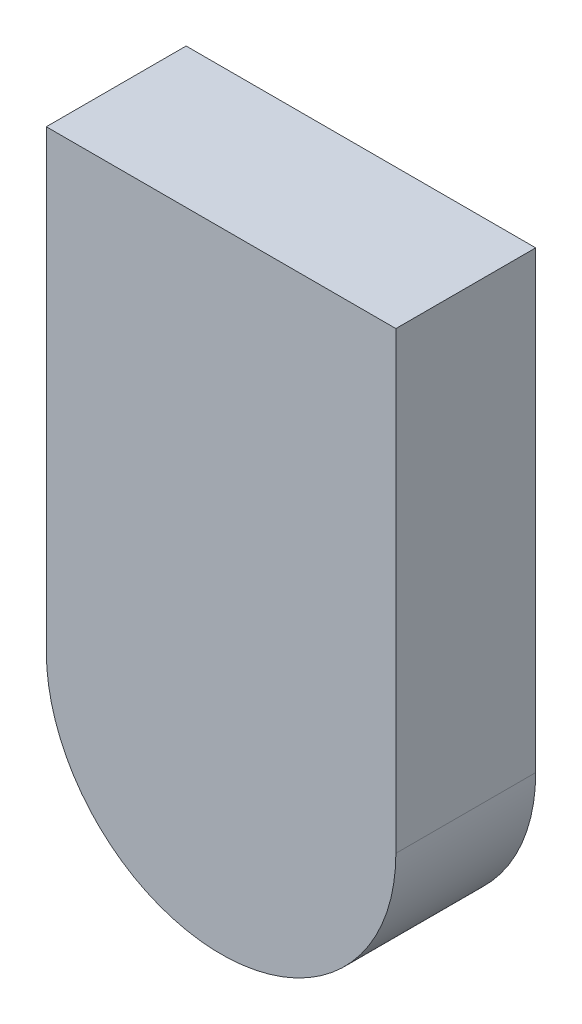
ISO-10303-21;
HEADER;
FILE_DESCRIPTION(('STEP AP214'),'2;1');
FILE_NAME('part.step','',(''),(''),'','','');
FILE_SCHEMA(('AUTOMOTIVE_DESIGN { 1 0 10303 214 1 1 1 1 }'));
ENDSEC;
DATA;
#1=APPLICATION_CONTEXT('core data for automotive mechanical design processes');
#2=APPLICATION_PROTOCOL_DEFINITION('international standard','automotive_design',2000,#1);
#3=PRODUCT_CONTEXT('',#1,'mechanical');
#4=PRODUCT('Part','Part','',(#3));
#5=PRODUCT_RELATED_PRODUCT_CATEGORY('part','',(#4));
#6=PRODUCT_DEFINITION_FORMATION('','',#4);
#7=PRODUCT_DEFINITION_CONTEXT('part definition',#1,'design');
#8=PRODUCT_DEFINITION('design','',#6,#7);
#9=PRODUCT_DEFINITION_SHAPE('','',#8);
#10=(LENGTH_UNIT() NAMED_UNIT(*) SI_UNIT(.MILLI.,.METRE.));
#11=(NAMED_UNIT(*) PLANE_ANGLE_UNIT() SI_UNIT($,.RADIAN.));
#12=(NAMED_UNIT(*) SI_UNIT($,.STERADIAN.) SOLID_ANGLE_UNIT());
#13=UNCERTAINTY_MEASURE_WITH_UNIT(LENGTH_MEASURE(1.E-05),#10,'distance_accuracy_value','');
#14=(GEOMETRIC_REPRESENTATION_CONTEXT(3) GLOBAL_UNCERTAINTY_ASSIGNED_CONTEXT((#13)) GLOBAL_UNIT_ASSIGNED_CONTEXT((#10,
#11,#12)) REPRESENTATION_CONTEXT('',''));
#15=CARTESIAN_POINT('',(0.,0.,0.));
#16=DIRECTION('',(0.,0.,1.));
#17=DIRECTION('',(1.,0.,0.));
#18=AXIS2_PLACEMENT_3D('',#15,#16,#17);
#19=CARTESIAN_POINT('',(0.125,2.05,0.));
#20=DIRECTION('',(0.,1.,0.));
#21=DIRECTION('',(1.,0.,0.));
#22=AXIS2_PLACEMENT_3D('',#19,#20,#21);
#23=PLANE('',#22);
#24=DIRECTION('',(0.,0.,1.));
#25=VECTOR('',#24,1.);
#26=CARTESIAN_POINT('',(0.125,2.05,0.));
#27=LINE('',#26,#25);
#28=CARTESIAN_POINT('',(0.125,2.05,0.));
#29=VERTEX_POINT('',#28);
#30=CARTESIAN_POINT('',(0.125,2.05,0.1));
#31=VERTEX_POINT('',#30);
#32=EDGE_CURVE('E11',#29,#31,#27,.T.);
#33=ORIENTED_EDGE('',*,*,#32,.T.);
#34=DIRECTION('',(1.,0.,0.));
#35=VECTOR('',#34,1.);
#36=CARTESIAN_POINT('',(0.125,2.05,0.1));
#37=LINE('',#36,#35);
#38=CARTESIAN_POINT('',(0.375,2.05,0.1));
#39=VERTEX_POINT('',#38);
#40=EDGE_CURVE('E24',#31,#39,#37,.T.);
#41=ORIENTED_EDGE('',*,*,#40,.T.);
#42=DIRECTION('',(0.,0.,1.));
#43=VECTOR('',#42,1.);
#44=CARTESIAN_POINT('',(0.375,2.05,0.));
#45=LINE('',#44,#43);
#46=CARTESIAN_POINT('',(0.375,2.05,0.));
#47=VERTEX_POINT('',#46);
#48=EDGE_CURVE('E85',#47,#39,#45,.T.);
#49=ORIENTED_EDGE('',*,*,#48,.F.);
#50=DIRECTION('',(1.,0.,0.));
#51=VECTOR('',#50,1.);
#52=CARTESIAN_POINT('',(0.125,2.05,0.));
#53=LINE('',#52,#51);
#54=EDGE_CURVE('E82',#29,#47,#53,.T.);
#55=ORIENTED_EDGE('',*,*,#54,.F.);
#56=EDGE_LOOP('',(#33,#41,#49,#55));
#57=FACE_BOUND('',#56,.T.);
#58=ADVANCED_FACE('F17',(#57),#23,.T.);
#59=CARTESIAN_POINT('',(0.375,2.05,0.));
#60=DIRECTION('',(1.,0.,0.));
#61=DIRECTION('',(0.,-1.,0.));
#62=AXIS2_PLACEMENT_3D('',#59,#60,#61);
#63=PLANE('',#62);
#64=ORIENTED_EDGE('',*,*,#48,.T.);
#65=DIRECTION('',(0.,-1.,0.));
#66=VECTOR('',#65,1.);
#67=CARTESIAN_POINT('',(0.375,2.05,0.1));
#68=LINE('',#67,#66);
#69=CARTESIAN_POINT('',(0.375,1.725,0.1));
#70=VERTEX_POINT('',#69);
#71=EDGE_CURVE('E80',#39,#70,#68,.T.);
#72=ORIENTED_EDGE('',*,*,#71,.T.);
#73=DIRECTION('',(0.,0.,1.));
#74=VECTOR('',#73,1.);
#75=CARTESIAN_POINT('',(0.375,1.725,0.));
#76=LINE('',#75,#74);
#77=CARTESIAN_POINT('',(0.375,1.725,0.));
#78=VERTEX_POINT('',#77);
#79=EDGE_CURVE('E60',#78,#70,#76,.T.);
#80=ORIENTED_EDGE('',*,*,#79,.F.);
#81=DIRECTION('',(0.,-1.,0.));
#82=VECTOR('',#81,1.);
#83=CARTESIAN_POINT('',(0.375,2.05,0.));
#84=LINE('',#83,#82);
#85=EDGE_CURVE('E76',#47,#78,#84,.T.);
#86=ORIENTED_EDGE('',*,*,#85,.F.);
#87=EDGE_LOOP('',(#64,#72,#80,#86));
#88=FACE_BOUND('',#87,.T.);
#89=ADVANCED_FACE('F89',(#88),#63,.T.);
#90=CARTESIAN_POINT('',(0.25,1.725,0.));
#91=DIRECTION('',(0.,0.,-1.));
#92=DIRECTION('',(1.,0.,0.));
#93=AXIS2_PLACEMENT_3D('',#90,#91,#92);
#94=CYLINDRICAL_SURFACE('',#93,0.125);
#95=CARTESIAN_POINT('',(0.25,1.725,0.));
#96=DIRECTION('',(0.,0.,1.));
#97=DIRECTION('',(1.,0.,0.));
#98=AXIS2_PLACEMENT_3D('',#95,#96,#97);
#99=CIRCLE('',#98,0.125);
#100=CARTESIAN_POINT('',(0.125,1.725,0.));
#101=VERTEX_POINT('',#100);
#102=EDGE_CURVE('E64',#101,#78,#99,.T.);
#103=ORIENTED_EDGE('',*,*,#102,.T.);
#104=ORIENTED_EDGE('',*,*,#79,.T.);
#105=CARTESIAN_POINT('',(0.25,1.725,0.1));
#106=DIRECTION('',(0.,0.,1.));
#107=DIRECTION('',(1.,0.,0.));
#108=AXIS2_PLACEMENT_3D('',#105,#106,#107);
#109=CIRCLE('',#108,0.125);
#110=CARTESIAN_POINT('',(0.125,1.725,0.1));
#111=VERTEX_POINT('',#110);
#112=EDGE_CURVE('E55',#111,#70,#109,.T.);
#113=ORIENTED_EDGE('',*,*,#112,.F.);
#114=DIRECTION('',(0.,0.,1.));
#115=VECTOR('',#114,1.);
#116=CARTESIAN_POINT('',(0.125,1.725,0.));
#117=LINE('',#116,#115);
#118=EDGE_CURVE('E59',#101,#111,#117,.T.);
#119=ORIENTED_EDGE('',*,*,#118,.F.);
#120=EDGE_LOOP('',(#103,#104,#113,#119));
#121=FACE_BOUND('',#120,.T.);
#122=ADVANCED_FACE('F58',(#121),#94,.T.);
#123=CARTESIAN_POINT('',(0.125,2.05,0.));
#124=DIRECTION('',(1.,0.,0.));
#125=DIRECTION('',(0.,-1.,0.));
#126=AXIS2_PLACEMENT_3D('',#123,#124,#125);
#127=PLANE('',#126);
#128=DIRECTION('',(0.,-1.,0.));
#129=VECTOR('',#128,1.);
#130=CARTESIAN_POINT('',(0.125,2.05,0.));
#131=LINE('',#130,#129);
#132=EDGE_CURVE('E69',#29,#101,#131,.T.);
#133=ORIENTED_EDGE('',*,*,#132,.T.);
#134=ORIENTED_EDGE('',*,*,#118,.T.);
#135=DIRECTION('',(0.,-1.,0.));
#136=VECTOR('',#135,1.);
#137=CARTESIAN_POINT('',(0.125,2.05,0.1));
#138=LINE('',#137,#136);
#139=EDGE_CURVE('E67',#31,#111,#138,.T.);
#140=ORIENTED_EDGE('',*,*,#139,.F.);
#141=ORIENTED_EDGE('',*,*,#32,.F.);
#142=EDGE_LOOP('',(#133,#134,#140,#141));
#143=FACE_BOUND('',#142,.T.);
#144=ADVANCED_FACE('F66',(#143),#127,.F.);
#145=CARTESIAN_POINT('',(0.25,1.850342514613,0.));
#146=DIRECTION('',(0.,0.,-1.));
#147=DIRECTION('',(-1.,0.,0.));
#148=AXIS2_PLACEMENT_3D('',#145,#146,#147);
#149=PLANE('',#148);
#150=ORIENTED_EDGE('',*,*,#54,.T.);
#151=ORIENTED_EDGE('',*,*,#85,.T.);
#152=ORIENTED_EDGE('',*,*,#102,.F.);
#153=ORIENTED_EDGE('',*,*,#132,.F.);
#154=EDGE_LOOP('',(#150,#151,#152,#153));
#155=FACE_BOUND('',#154,.T.);
#156=ADVANCED_FACE('F91',(#155),#149,.T.);
#157=CARTESIAN_POINT('',(0.25,1.850342514613,0.1));
#158=DIRECTION('',(0.,0.,-1.));
#159=DIRECTION('',(-1.,0.,0.));
#160=AXIS2_PLACEMENT_3D('',#157,#158,#159);
#161=PLANE('',#160);
#162=ORIENTED_EDGE('',*,*,#139,.T.);
#163=ORIENTED_EDGE('',*,*,#112,.T.);
#164=ORIENTED_EDGE('',*,*,#71,.F.);
#165=ORIENTED_EDGE('',*,*,#40,.F.);
#166=EDGE_LOOP('',(#162,#163,#164,#165));
#167=FACE_BOUND('',#166,.T.);
#168=ADVANCED_FACE('F71',(#167),#161,.F.);
#169=CLOSED_SHELL('',(#58,#89,#122,#144,#156,#168));
#170=MANIFOLD_SOLID_BREP('B1',#169);
#171=ADVANCED_BREP_SHAPE_REPRESENTATION('',(#18,#170),#14);
#172=SHAPE_DEFINITION_REPRESENTATION(#9,#171);
ENDSEC;
END-ISO-10303-21;
